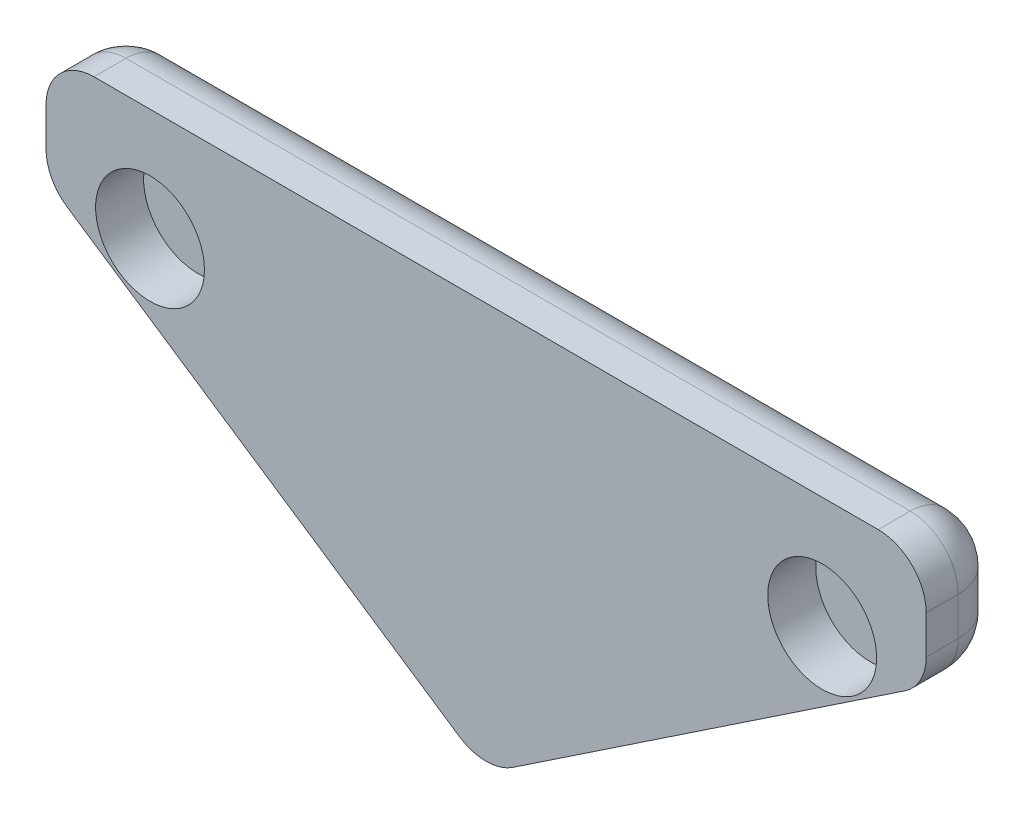
ISO-10303-21;
HEADER;
FILE_DESCRIPTION(('STEP AP214'),'2;1');
FILE_NAME('part.step','',(''),(''),'','','');
FILE_SCHEMA(('AUTOMOTIVE_DESIGN { 1 0 10303 214 1 1 1 1 }'));
ENDSEC;
DATA;
#1=APPLICATION_CONTEXT('core data for automotive mechanical design processes');
#2=APPLICATION_PROTOCOL_DEFINITION('international standard','automotive_design',2000,#1);
#3=PRODUCT_CONTEXT('',#1,'mechanical');
#4=PRODUCT('Part','Part','',(#3));
#5=PRODUCT_RELATED_PRODUCT_CATEGORY('part','',(#4));
#6=PRODUCT_DEFINITION_FORMATION('','',#4);
#7=PRODUCT_DEFINITION_CONTEXT('part definition',#1,'design');
#8=PRODUCT_DEFINITION('design','',#6,#7);
#9=PRODUCT_DEFINITION_SHAPE('','',#8);
#10=(LENGTH_UNIT() NAMED_UNIT(*) SI_UNIT(.MILLI.,.METRE.));
#11=(NAMED_UNIT(*) PLANE_ANGLE_UNIT() SI_UNIT($,.RADIAN.));
#12=(NAMED_UNIT(*) SI_UNIT($,.STERADIAN.) SOLID_ANGLE_UNIT());
#13=UNCERTAINTY_MEASURE_WITH_UNIT(LENGTH_MEASURE(1.E-05),#10,'distance_accuracy_value','');
#14=(GEOMETRIC_REPRESENTATION_CONTEXT(3) GLOBAL_UNCERTAINTY_ASSIGNED_CONTEXT((#13)) GLOBAL_UNIT_ASSIGNED_CONTEXT((#10,
#11,#12)) REPRESENTATION_CONTEXT('',''));
#15=CARTESIAN_POINT('',(0.,0.,0.));
#16=DIRECTION('',(0.,0.,1.));
#17=DIRECTION('',(1.,0.,0.));
#18=AXIS2_PLACEMENT_3D('',#15,#16,#17);
#19=CARTESIAN_POINT('',(6.18580381973495,12.7,2.5));
#20=DIRECTION('',(0.,-1.,0.));
#21=DIRECTION('',(1.,0.,0.));
#22=AXIS2_PLACEMENT_3D('',#19,#20,#21);
#23=PLANE('',#22);
#24=DIRECTION('',(-1.,0.,0.));
#25=VECTOR('',#24,1.);
#26=CARTESIAN_POINT('',(6.18580381973495,12.7,2.5));
#27=LINE('',#26,#25);
#28=CARTESIAN_POINT('',(18.4358038197349,12.7,2.5));
#29=VERTEX_POINT('',#28);
#30=CARTESIAN_POINT('',(-6.06419618026506,12.7,2.5));
#31=VERTEX_POINT('',#30);
#32=EDGE_CURVE('E307',#29,#31,#27,.T.);
#33=ORIENTED_EDGE('',*,*,#32,.F.);
#34=DIRECTION('',(0.,0.,-1.));
#35=VECTOR('',#34,1.);
#36=CARTESIAN_POINT('',(18.4358038197349,12.7,2.5));
#37=LINE('',#36,#35);
#38=CARTESIAN_POINT('',(18.4358038197349,12.7,1.5));
#39=VERTEX_POINT('',#38);
#40=EDGE_CURVE('E197',#29,#39,#37,.T.);
#41=ORIENTED_EDGE('',*,*,#40,.T.);
#42=DIRECTION('',(-1.,0.,0.));
#43=VECTOR('',#42,1.);
#44=CARTESIAN_POINT('',(6.18580381973495,12.7,1.5));
#45=LINE('',#44,#43);
#46=CARTESIAN_POINT('',(-6.06419618026506,12.7,1.5));
#47=VERTEX_POINT('',#46);
#48=EDGE_CURVE('E150',#39,#47,#45,.T.);
#49=ORIENTED_EDGE('',*,*,#48,.T.);
#50=DIRECTION('',(0.,0.,-1.));
#51=VECTOR('',#50,1.);
#52=CARTESIAN_POINT('',(-6.06419618026506,12.7,2.5));
#53=LINE('',#52,#51);
#54=EDGE_CURVE('E194',#47,#31,#53,.F.);
#55=ORIENTED_EDGE('',*,*,#54,.T.);
#56=EDGE_LOOP('',(#33,#41,#49,#55));
#57=FACE_BOUND('',#56,.T.);
#58=ADVANCED_FACE('F45',(#57),#23,.F.);
#59=CARTESIAN_POINT('',(-7.56419618026505,12.7,2.5));
#60=DIRECTION('',(1.,0.,0.));
#61=DIRECTION('',(0.,1.,0.));
#62=AXIS2_PLACEMENT_3D('',#59,#60,#61);
#63=PLANE('',#62);
#64=DIRECTION('',(0.,-1.,0.));
#65=VECTOR('',#64,1.);
#66=CARTESIAN_POINT('',(-7.56419618026505,12.7,1.5));
#67=LINE('',#66,#65);
#68=CARTESIAN_POINT('',(-7.56419618026506,11.2,1.5));
#69=VERTEX_POINT('',#68);
#70=CARTESIAN_POINT('',(-7.56419618026506,10.0011589018753,1.5));
#71=VERTEX_POINT('',#70);
#72=EDGE_CURVE('E167',#69,#71,#67,.T.);
#73=ORIENTED_EDGE('',*,*,#72,.T.);
#74=DIRECTION('',(0.,0.,-1.));
#75=VECTOR('',#74,1.);
#76=CARTESIAN_POINT('',(-7.56419618026506,10.0011589018753,2.5));
#77=LINE('',#76,#75);
#78=CARTESIAN_POINT('',(-7.56419618026506,10.0011589018753,2.5));
#79=VERTEX_POINT('',#78);
#80=EDGE_CURVE('E178',#71,#79,#77,.F.);
#81=ORIENTED_EDGE('',*,*,#80,.T.);
#82=DIRECTION('',(0.,-1.,0.));
#83=VECTOR('',#82,1.);
#84=CARTESIAN_POINT('',(-7.56419618026505,12.7,2.5));
#85=LINE('',#84,#83);
#86=CARTESIAN_POINT('',(-7.56419618026506,11.2,2.5));
#87=VERTEX_POINT('',#86);
#88=EDGE_CURVE('E145',#87,#79,#85,.T.);
#89=ORIENTED_EDGE('',*,*,#88,.F.);
#90=DIRECTION('',(0.,0.,-1.));
#91=VECTOR('',#90,1.);
#92=CARTESIAN_POINT('',(-7.56419618026506,11.2,2.5));
#93=LINE('',#92,#91);
#94=EDGE_CURVE('E171',#87,#69,#93,.T.);
#95=ORIENTED_EDGE('',*,*,#94,.T.);
#96=EDGE_LOOP('',(#73,#81,#89,#95));
#97=FACE_BOUND('',#96,.T.);
#98=ADVANCED_FACE('F380',(#97),#63,.F.);
#99=CARTESIAN_POINT('',(-7.56419618026506,9.19999999999999,2.5));
#100=DIRECTION('',(0.556094302115672,0.831119201531576,0.));
#101=DIRECTION('',(-0.831119201531576,0.556094302115672,0.));
#102=AXIS2_PLACEMENT_3D('',#99,#100,#101);
#103=PLANE('',#102);
#104=DIRECTION('',(0.831119201531576,-0.556094302115672,0.));
#105=VECTOR('',#104,1.);
#106=CARTESIAN_POINT('',(-7.56419618026506,9.19999999999999,2.5));
#107=LINE('',#106,#105);
#108=CARTESIAN_POINT('',(-6.89833763343856,8.7544800995779,2.5));
#109=VERTEX_POINT('',#108);
#110=CARTESIAN_POINT('',(5.35166236656144,0.558116463214275,2.5));
#111=VERTEX_POINT('',#110);
#112=EDGE_CURVE('E142',#109,#111,#107,.T.);
#113=ORIENTED_EDGE('',*,*,#112,.F.);
#114=DIRECTION('',(0.,0.,-1.));
#115=VECTOR('',#114,1.);
#116=CARTESIAN_POINT('',(-6.89833763343856,8.7544800995779,2.5));
#117=LINE('',#116,#115);
#118=CARTESIAN_POINT('',(-6.89833763343856,8.7544800995779,1.5));
#119=VERTEX_POINT('',#118);
#120=EDGE_CURVE('E156',#109,#119,#117,.T.);
#121=ORIENTED_EDGE('',*,*,#120,.T.);
#122=DIRECTION('',(0.831119201531576,-0.556094302115672,0.));
#123=VECTOR('',#122,1.);
#124=CARTESIAN_POINT('',(-7.56419618026506,9.19999999999999,1.5));
#125=LINE('',#124,#123);
#126=CARTESIAN_POINT('',(5.35166236656144,0.558116463214273,1.5));
#127=VERTEX_POINT('',#126);
#128=EDGE_CURVE('E160',#119,#127,#125,.T.);
#129=ORIENTED_EDGE('',*,*,#128,.T.);
#130=DIRECTION('',(0.,0.,-1.));
#131=VECTOR('',#130,1.);
#132=CARTESIAN_POINT('',(5.35166236656144,0.558116463214272,2.5));
#133=LINE('',#132,#131);
#134=EDGE_CURVE('E158',#127,#111,#133,.F.);
#135=ORIENTED_EDGE('',*,*,#134,.T.);
#136=EDGE_LOOP('',(#113,#121,#129,#135));
#137=FACE_BOUND('',#136,.T.);
#138=ADVANCED_FACE('F155',(#137),#103,.F.);
#139=CARTESIAN_POINT('',(0.,0.,2.5));
#140=DIRECTION('',(0.,0.,1.));
#141=DIRECTION('',(1.,0.,0.));
#142=AXIS2_PLACEMENT_3D('',#139,#140,#141);
#143=PLANE('',#142);
#144=CARTESIAN_POINT('',(-4.31419618026505,9.2,2.5));
#145=DIRECTION('',(0.,0.,1.));
#146=DIRECTION('',(1.,0.,0.));
#147=AXIS2_PLACEMENT_3D('',#144,#145,#146);
#148=CIRCLE('',#147,1.7);
#149=CARTESIAN_POINT('',(-2.61419618026505,9.2,2.5));
#150=VERTEX_POINT('',#149);
#151=EDGE_CURVE('E302',#150,#150,#148,.T.);
#152=ORIENTED_EDGE('',*,*,#151,.F.);
#153=EDGE_LOOP('',(#152));
#154=FACE_BOUND('',#153,.T.);
#155=ORIENTED_EDGE('',*,*,#88,.T.);
#156=CARTESIAN_POINT('',(-6.06419618026506,10.0011589018753,2.5));
#157=DIRECTION('',(0.,0.,1.));
#158=DIRECTION('',(1.,0.,0.));
#159=AXIS2_PLACEMENT_3D('',#156,#157,#158);
#160=CIRCLE('',#159,1.5);
#161=EDGE_CURVE('E138',#79,#109,#160,.T.);
#162=ORIENTED_EDGE('',*,*,#161,.T.);
#163=ORIENTED_EDGE('',*,*,#112,.T.);
#164=CARTESIAN_POINT('',(6.18580381973495,1.80479526551163,2.5));
#165=DIRECTION('',(0.,0.,1.));
#166=DIRECTION('',(1.,0.,0.));
#167=AXIS2_PLACEMENT_3D('',#164,#165,#166);
#168=CIRCLE('',#167,1.5);
#169=CARTESIAN_POINT('',(7.01994527290846,0.558116463214273,2.5));
#170=VERTEX_POINT('',#169);
#171=EDGE_CURVE('E184',#111,#170,#168,.T.);
#172=ORIENTED_EDGE('',*,*,#171,.T.);
#173=DIRECTION('',(-0.831119201531576,-0.556094302115672,0.));
#174=VECTOR('',#173,1.);
#175=CARTESIAN_POINT('',(19.935803819735,9.19999999999999,2.5));
#176=LINE('',#175,#174);
#177=CARTESIAN_POINT('',(19.2699452729085,8.7544800995779,2.5));
#178=VERTEX_POINT('',#177);
#179=EDGE_CURVE('E298',#178,#170,#176,.T.);
#180=ORIENTED_EDGE('',*,*,#179,.F.);
#181=CARTESIAN_POINT('',(18.435803819735,10.0011589018753,2.5));
#182=DIRECTION('',(0.,0.,1.));
#183=DIRECTION('',(1.,0.,0.));
#184=AXIS2_PLACEMENT_3D('',#181,#182,#183);
#185=CIRCLE('',#184,1.5);
#186=CARTESIAN_POINT('',(19.935803819735,10.0011589018753,2.5));
#187=VERTEX_POINT('',#186);
#188=EDGE_CURVE('E187',#178,#187,#185,.T.);
#189=ORIENTED_EDGE('',*,*,#188,.T.);
#190=DIRECTION('',(0.,-1.,0.));
#191=VECTOR('',#190,1.);
#192=CARTESIAN_POINT('',(19.935803819735,12.7,2.5));
#193=LINE('',#192,#191);
#194=CARTESIAN_POINT('',(19.935803819735,11.2,2.5));
#195=VERTEX_POINT('',#194);
#196=EDGE_CURVE('E292',#195,#187,#193,.T.);
#197=ORIENTED_EDGE('',*,*,#196,.F.);
#198=CARTESIAN_POINT('',(18.4358038197349,11.2,2.5));
#199=DIRECTION('',(0.,0.,1.));
#200=DIRECTION('',(1.,0.,0.));
#201=AXIS2_PLACEMENT_3D('',#198,#199,#200);
#202=CIRCLE('',#201,1.5);
#203=EDGE_CURVE('E151',#195,#29,#202,.T.);
#204=ORIENTED_EDGE('',*,*,#203,.T.);
#205=ORIENTED_EDGE('',*,*,#32,.T.);
#206=CARTESIAN_POINT('',(-6.06419618026506,11.2,2.5));
#207=DIRECTION('',(0.,0.,1.));
#208=DIRECTION('',(1.,0.,0.));
#209=AXIS2_PLACEMENT_3D('',#206,#207,#208);
#210=CIRCLE('',#209,1.5);
#211=EDGE_CURVE('E181',#31,#87,#210,.T.);
#212=ORIENTED_EDGE('',*,*,#211,.T.);
#213=EDGE_LOOP('',(#155,#162,#163,#172,#180,#189,#197,#204,#205,#212));
#214=FACE_BOUND('',#213,.T.);
#215=CARTESIAN_POINT('',(16.685803819735,9.2,2.5));
#216=DIRECTION('',(0.,0.,-1.));
#217=DIRECTION('',(-1.,0.,0.));
#218=AXIS2_PLACEMENT_3D('',#215,#216,#217);
#219=CIRCLE('',#218,1.7);
#220=CARTESIAN_POINT('',(14.985803819735,9.2,2.5));
#221=VERTEX_POINT('',#220);
#222=EDGE_CURVE('E283',#221,#221,#219,.T.);
#223=ORIENTED_EDGE('',*,*,#222,.T.);
#224=EDGE_LOOP('',(#223));
#225=FACE_BOUND('',#224,.T.);
#226=ADVANCED_FACE('F140',(#154,#214,#225),#143,.T.);
#227=CARTESIAN_POINT('',(0.,0.,0.));
#228=DIRECTION('',(0.,0.,1.));
#229=DIRECTION('',(1.,0.,0.));
#230=AXIS2_PLACEMENT_3D('',#227,#228,#229);
#231=PLANE('',#230);
#232=DIRECTION('',(-1.,0.,0.));
#233=VECTOR('',#232,1.);
#234=CARTESIAN_POINT('',(0.,11.2,0.));
#235=LINE('',#234,#233);
#236=CARTESIAN_POINT('',(-6.06419618026506,11.2,0.));
#237=VERTEX_POINT('',#236);
#238=CARTESIAN_POINT('',(18.4358038197349,11.2,0.));
#239=VERTEX_POINT('',#238);
#240=EDGE_CURVE('E218',#237,#239,#235,.F.);
#241=ORIENTED_EDGE('',*,*,#240,.T.);
#242=DIRECTION('',(0.,-1.,0.));
#243=VECTOR('',#242,1.);
#244=CARTESIAN_POINT('',(18.435803819735,0.,0.));
#245=LINE('',#244,#243);
#246=CARTESIAN_POINT('',(18.435803819735,10.0011589018753,0.));
#247=VERTEX_POINT('',#246);
#248=EDGE_CURVE('E11',#239,#247,#245,.T.);
#249=ORIENTED_EDGE('',*,*,#248,.T.);
#250=DIRECTION('',(-0.831119201531576,-0.556094302115672,0.));
#251=VECTOR('',#250,1.);
#252=CARTESIAN_POINT('',(1.07876191929246,-1.61228004242079,0.));
#253=LINE('',#252,#251);
#254=CARTESIAN_POINT('',(6.18580381973495,1.80479526551164,0.));
#255=VERTEX_POINT('',#254);
#256=EDGE_CURVE('E55',#247,#255,#253,.T.);
#257=ORIENTED_EDGE('',*,*,#256,.T.);
#258=DIRECTION('',(0.831119201531576,-0.556094302115672,0.));
#259=VECTOR('',#258,1.);
#260=CARTESIAN_POINT('',(2.74704482563947,4.10563764701552,0.));
#261=LINE('',#260,#259);
#262=CARTESIAN_POINT('',(-6.06419618026506,10.0011589018753,0.));
#263=VERTEX_POINT('',#262);
#264=EDGE_CURVE('E224',#255,#263,#261,.F.);
#265=ORIENTED_EDGE('',*,*,#264,.T.);
#266=DIRECTION('',(0.,-1.,0.));
#267=VECTOR('',#266,1.);
#268=CARTESIAN_POINT('',(-6.06419618026507,0.,0.));
#269=LINE('',#268,#267);
#270=EDGE_CURVE('E221',#263,#237,#269,.F.);
#271=ORIENTED_EDGE('',*,*,#270,.T.);
#272=EDGE_LOOP('',(#241,#249,#257,#265,#271));
#273=FACE_BOUND('',#272,.T.);
#274=ADVANCED_FACE('F329',(#273),#231,.F.);
#275=CARTESIAN_POINT('',(-4.31419618026505,9.2,1.));
#276=DIRECTION('',(0.,0.,1.));
#277=DIRECTION('',(1.,0.,0.));
#278=AXIS2_PLACEMENT_3D('',#275,#276,#277);
#279=CYLINDRICAL_SURFACE('',#278,1.7);
#280=CARTESIAN_POINT('',(-4.31419618026505,9.2,1.));
#281=DIRECTION('',(0.,0.,1.));
#282=DIRECTION('',(1.,0.,0.));
#283=AXIS2_PLACEMENT_3D('',#280,#281,#282);
#284=CIRCLE('',#283,1.7);
#285=CARTESIAN_POINT('',(-2.61419618026505,9.2,1.));
#286=VERTEX_POINT('',#285);
#287=EDGE_CURVE('E303',#286,#286,#284,.T.);
#288=ORIENTED_EDGE('',*,*,#287,.F.);
#289=EDGE_LOOP('',(#288));
#290=FACE_BOUND('',#289,.T.);
#291=ORIENTED_EDGE('',*,*,#151,.T.);
#292=EDGE_LOOP('',(#291));
#293=FACE_BOUND('',#292,.T.);
#294=ADVANCED_FACE('F579',(#290,#293),#279,.F.);
#295=CARTESIAN_POINT('',(-4.31419618026505,9.2,1.));
#296=DIRECTION('',(0.,0.,1.));
#297=DIRECTION('',(1.,0.,0.));
#298=AXIS2_PLACEMENT_3D('',#295,#296,#297);
#299=PLANE('',#298);
#300=ORIENTED_EDGE('',*,*,#287,.T.);
#301=EDGE_LOOP('',(#300));
#302=FACE_BOUND('',#301,.T.);
#303=ADVANCED_FACE('F567',(#302),#299,.T.);
#304=CARTESIAN_POINT('',(19.935803819735,12.7,2.5));
#305=DIRECTION('',(-1.,0.,0.));
#306=DIRECTION('',(0.,1.,0.));
#307=AXIS2_PLACEMENT_3D('',#304,#305,#306);
#308=PLANE('',#307);
#309=DIRECTION('',(0.,-1.,0.));
#310=VECTOR('',#309,1.);
#311=CARTESIAN_POINT('',(19.935803819735,12.7,1.5));
#312=LINE('',#311,#310);
#313=CARTESIAN_POINT('',(19.935803819735,10.0011589018753,1.5));
#314=VERTEX_POINT('',#313);
#315=CARTESIAN_POINT('',(19.935803819735,11.2,1.5));
#316=VERTEX_POINT('',#315);
#317=EDGE_CURVE('E200',#314,#316,#312,.F.);
#318=ORIENTED_EDGE('',*,*,#317,.T.);
#319=DIRECTION('',(0.,0.,-1.));
#320=VECTOR('',#319,1.);
#321=CARTESIAN_POINT('',(19.935803819735,11.2,2.5));
#322=LINE('',#321,#320);
#323=EDGE_CURVE('E206',#316,#195,#322,.F.);
#324=ORIENTED_EDGE('',*,*,#323,.T.);
#325=ORIENTED_EDGE('',*,*,#196,.T.);
#326=DIRECTION('',(0.,0.,-1.));
#327=VECTOR('',#326,1.);
#328=CARTESIAN_POINT('',(19.935803819735,10.0011589018753,2.5));
#329=LINE('',#328,#327);
#330=EDGE_CURVE('E203',#187,#314,#329,.T.);
#331=ORIENTED_EDGE('',*,*,#330,.T.);
#332=EDGE_LOOP('',(#318,#324,#325,#331));
#333=FACE_BOUND('',#332,.T.);
#334=ADVANCED_FACE('F359',(#333),#308,.F.);
#335=CARTESIAN_POINT('',(19.935803819735,9.19999999999999,2.5));
#336=DIRECTION('',(-0.556094302115672,0.831119201531576,0.));
#337=DIRECTION('',(0.831119201531576,0.556094302115672,0.));
#338=AXIS2_PLACEMENT_3D('',#335,#336,#337);
#339=PLANE('',#338);
#340=DIRECTION('',(-0.831119201531576,-0.556094302115672,0.));
#341=VECTOR('',#340,1.);
#342=CARTESIAN_POINT('',(19.935803819735,9.19999999999999,1.5));
#343=LINE('',#342,#341);
#344=CARTESIAN_POINT('',(7.01994527290846,0.558116463214272,1.5));
#345=VERTEX_POINT('',#344);
#346=CARTESIAN_POINT('',(19.2699452729085,8.7544800995779,1.5));
#347=VERTEX_POINT('',#346);
#348=EDGE_CURVE('E212',#345,#347,#343,.F.);
#349=ORIENTED_EDGE('',*,*,#348,.T.);
#350=DIRECTION('',(0.,0.,-1.));
#351=VECTOR('',#350,1.);
#352=CARTESIAN_POINT('',(19.2699452729085,8.7544800995779,2.5));
#353=LINE('',#352,#351);
#354=EDGE_CURVE('E215',#347,#178,#353,.F.);
#355=ORIENTED_EDGE('',*,*,#354,.T.);
#356=ORIENTED_EDGE('',*,*,#179,.T.);
#357=DIRECTION('',(0.,0.,-1.));
#358=VECTOR('',#357,1.);
#359=CARTESIAN_POINT('',(7.01994527290846,0.558116463214272,2.5));
#360=LINE('',#359,#358);
#361=EDGE_CURVE('E209',#170,#345,#360,.T.);
#362=ORIENTED_EDGE('',*,*,#361,.T.);
#363=EDGE_LOOP('',(#349,#355,#356,#362));
#364=FACE_BOUND('',#363,.T.);
#365=ADVANCED_FACE('F367',(#364),#339,.F.);
#366=CARTESIAN_POINT('',(16.685803819735,9.2,1.));
#367=DIRECTION('',(0.,0.,1.));
#368=DIRECTION('',(-1.,0.,0.));
#369=AXIS2_PLACEMENT_3D('',#366,#367,#368);
#370=CYLINDRICAL_SURFACE('',#369,1.7);
#371=CARTESIAN_POINT('',(16.685803819735,9.2,1.));
#372=DIRECTION('',(0.,0.,-1.));
#373=DIRECTION('',(-1.,0.,0.));
#374=AXIS2_PLACEMENT_3D('',#371,#372,#373);
#375=CIRCLE('',#374,1.7);
#376=CARTESIAN_POINT('',(14.985803819735,9.2,1.));
#377=VERTEX_POINT('',#376);
#378=EDGE_CURVE('E287',#377,#377,#375,.T.);
#379=ORIENTED_EDGE('',*,*,#378,.T.);
#380=EDGE_LOOP('',(#379));
#381=FACE_BOUND('',#380,.T.);
#382=ORIENTED_EDGE('',*,*,#222,.F.);
#383=EDGE_LOOP('',(#382));
#384=FACE_BOUND('',#383,.T.);
#385=ADVANCED_FACE('F554',(#381,#384),#370,.F.);
#386=CARTESIAN_POINT('',(16.685803819735,9.2,1.));
#387=DIRECTION('',(0.,0.,1.));
#388=DIRECTION('',(-1.,0.,0.));
#389=AXIS2_PLACEMENT_3D('',#386,#387,#388);
#390=PLANE('',#389);
#391=ORIENTED_EDGE('',*,*,#378,.F.);
#392=EDGE_LOOP('',(#391));
#393=FACE_BOUND('',#392,.T.);
#394=ADVANCED_FACE('F542',(#393),#390,.T.);
#395=CARTESIAN_POINT('',(18.435803819735,10.0011589018753,2.5));
#396=DIRECTION('',(0.,0.,-1.));
#397=DIRECTION('',(-1.,0.,0.));
#398=AXIS2_PLACEMENT_3D('',#395,#396,#397);
#399=CYLINDRICAL_SURFACE('',#398,1.5);
#400=ORIENTED_EDGE('',*,*,#188,.F.);
#401=ORIENTED_EDGE('',*,*,#354,.F.);
#402=CARTESIAN_POINT('',(18.435803819735,10.0011589018753,1.5));
#403=DIRECTION('',(0.,0.,-1.));
#404=DIRECTION('',(-1.,0.,0.));
#405=AXIS2_PLACEMENT_3D('',#402,#403,#404);
#406=CIRCLE('',#405,1.5);
#407=EDGE_CURVE('E49',#314,#347,#406,.T.);
#408=ORIENTED_EDGE('',*,*,#407,.F.);
#409=ORIENTED_EDGE('',*,*,#330,.F.);
#410=EDGE_LOOP('',(#400,#401,#408,#409));
#411=FACE_BOUND('',#410,.T.);
#412=ADVANCED_FACE('F47',(#411),#399,.T.);
#413=CARTESIAN_POINT('',(18.435803819735,0.,1.5));
#414=DIRECTION('',(0.,-1.,0.));
#415=DIRECTION('',(1.,0.,0.));
#416=AXIS2_PLACEMENT_3D('',#413,#414,#415);
#417=CYLINDRICAL_SURFACE('',#416,1.5);
#418=CARTESIAN_POINT('',(18.4358038197349,11.2,1.5));
#419=DIRECTION('',(0.,1.,0.));
#420=DIRECTION('',(-1.,0.,0.));
#421=AXIS2_PLACEMENT_3D('',#418,#419,#420);
#422=CIRCLE('',#421,1.5);
#423=EDGE_CURVE('E273',#316,#239,#422,.T.);
#424=ORIENTED_EDGE('',*,*,#423,.F.);
#425=ORIENTED_EDGE('',*,*,#317,.F.);
#426=CARTESIAN_POINT('',(18.435803819735,10.0011589018753,1.5));
#427=DIRECTION('',(0.,-1.,0.));
#428=DIRECTION('',(1.,0.,0.));
#429=AXIS2_PLACEMENT_3D('',#426,#427,#428);
#430=CIRCLE('',#429,1.5);
#431=EDGE_CURVE('E276',#247,#314,#430,.T.);
#432=ORIENTED_EDGE('',*,*,#431,.F.);
#433=ORIENTED_EDGE('',*,*,#248,.F.);
#434=EDGE_LOOP('',(#424,#425,#432,#433));
#435=FACE_BOUND('',#434,.T.);
#436=ADVANCED_FACE('F347',(#435),#417,.T.);
#437=CARTESIAN_POINT('',(18.4358038197349,11.2,2.5));
#438=DIRECTION('',(0.,0.,-1.));
#439=DIRECTION('',(-1.,0.,0.));
#440=AXIS2_PLACEMENT_3D('',#437,#438,#439);
#441=CYLINDRICAL_SURFACE('',#440,1.5);
#442=ORIENTED_EDGE('',*,*,#203,.F.);
#443=ORIENTED_EDGE('',*,*,#323,.F.);
#444=CARTESIAN_POINT('',(18.4358038197349,11.2,1.5));
#445=DIRECTION('',(0.,0.,-1.));
#446=DIRECTION('',(-1.,0.,0.));
#447=AXIS2_PLACEMENT_3D('',#444,#445,#446);
#448=CIRCLE('',#447,1.5);
#449=EDGE_CURVE('E269',#39,#316,#448,.T.);
#450=ORIENTED_EDGE('',*,*,#449,.F.);
#451=ORIENTED_EDGE('',*,*,#40,.F.);
#452=EDGE_LOOP('',(#442,#443,#450,#451));
#453=FACE_BOUND('',#452,.T.);
#454=ADVANCED_FACE('F356',(#453),#441,.T.);
#455=CARTESIAN_POINT('',(18.435803819735,10.0011589018753,1.5));
#456=DIRECTION('',(0.,0.,-1.));
#457=DIRECTION('',(-1.,0.,0.));
#458=AXIS2_PLACEMENT_3D('',#455,#456,#457);
#459=SPHERICAL_SURFACE('',#458,1.5);
#460=ORIENTED_EDGE('',*,*,#431,.T.);
#461=ORIENTED_EDGE('',*,*,#407,.T.);
#462=CARTESIAN_POINT('',(18.435803819735,10.0011589018753,1.5));
#463=DIRECTION('',(0.831119201531575,0.556094302115673,0.));
#464=DIRECTION('',(-0.556094302115673,0.831119201531575,0.));
#465=AXIS2_PLACEMENT_3D('',#462,#463,#464);
#466=CIRCLE('',#465,1.5);
#467=EDGE_CURVE('E266',#247,#347,#466,.F.);
#468=ORIENTED_EDGE('',*,*,#467,.F.);
#469=EDGE_LOOP('',(#460,#461,#468));
#470=FACE_BOUND('',#469,.T.);
#471=ADVANCED_FACE('F370',(#470),#459,.T.);
#472=CARTESIAN_POINT('',(18.4358038197349,11.2,1.5));
#473=DIRECTION('',(1.,0.,0.));
#474=DIRECTION('',(0.,1.,0.));
#475=AXIS2_PLACEMENT_3D('',#472,#473,#474);
#476=SPHERICAL_SURFACE('',#475,1.5);
#477=ORIENTED_EDGE('',*,*,#449,.T.);
#478=ORIENTED_EDGE('',*,*,#423,.T.);
#479=CARTESIAN_POINT('',(18.4358038197349,11.2,1.5));
#480=DIRECTION('',(1.,0.,0.));
#481=DIRECTION('',(0.,0.,-1.));
#482=AXIS2_PLACEMENT_3D('',#479,#480,#481);
#483=CIRCLE('',#482,1.5);
#484=EDGE_CURVE('E262',#39,#239,#483,.F.);
#485=ORIENTED_EDGE('',*,*,#484,.F.);
#486=EDGE_LOOP('',(#477,#478,#485));
#487=FACE_BOUND('',#486,.T.);
#488=ADVANCED_FACE('F350',(#487),#476,.T.);
#489=CARTESIAN_POINT('',(6.18580381973495,1.80479526551163,2.5));
#490=DIRECTION('',(0.,0.,-1.));
#491=DIRECTION('',(-1.,0.,0.));
#492=AXIS2_PLACEMENT_3D('',#489,#490,#491);
#493=CYLINDRICAL_SURFACE('',#492,1.5);
#494=ORIENTED_EDGE('',*,*,#171,.F.);
#495=ORIENTED_EDGE('',*,*,#134,.F.);
#496=CARTESIAN_POINT('',(6.18580381973495,1.80479526551164,1.5));
#497=DIRECTION('',(0.,0.,-1.));
#498=DIRECTION('',(-1.,0.,0.));
#499=AXIS2_PLACEMENT_3D('',#496,#497,#498);
#500=CIRCLE('',#499,1.5);
#501=EDGE_CURVE('E258',#345,#127,#500,.T.);
#502=ORIENTED_EDGE('',*,*,#501,.F.);
#503=ORIENTED_EDGE('',*,*,#361,.F.);
#504=EDGE_LOOP('',(#494,#495,#502,#503));
#505=FACE_BOUND('',#504,.T.);
#506=ADVANCED_FACE('F321',(#505),#493,.T.);
#507=CARTESIAN_POINT('',(1.07876191929246,-1.61228004242079,1.5));
#508=DIRECTION('',(-0.831119201531576,-0.556094302115672,0.));
#509=DIRECTION('',(0.556094302115672,-0.831119201531576,0.));
#510=AXIS2_PLACEMENT_3D('',#507,#508,#509);
#511=CYLINDRICAL_SURFACE('',#510,1.5);
#512=ORIENTED_EDGE('',*,*,#467,.T.);
#513=ORIENTED_EDGE('',*,*,#348,.F.);
#514=CARTESIAN_POINT('',(6.18580381973495,1.80479526551164,1.5));
#515=DIRECTION('',(-0.831119201531576,-0.556094302115671,0.));
#516=DIRECTION('',(0.556094302115671,-0.831119201531576,0.));
#517=AXIS2_PLACEMENT_3D('',#514,#515,#516);
#518=CIRCLE('',#517,1.5);
#519=EDGE_CURVE('E254',#255,#345,#518,.T.);
#520=ORIENTED_EDGE('',*,*,#519,.F.);
#521=ORIENTED_EDGE('',*,*,#256,.F.);
#522=EDGE_LOOP('',(#512,#513,#520,#521));
#523=FACE_BOUND('',#522,.T.);
#524=ADVANCED_FACE('F369',(#523),#511,.T.);
#525=CARTESIAN_POINT('',(6.18580381973495,11.2,1.5));
#526=DIRECTION('',(-1.,0.,0.));
#527=DIRECTION('',(0.,-1.,0.));
#528=AXIS2_PLACEMENT_3D('',#525,#526,#527);
#529=CYLINDRICAL_SURFACE('',#528,1.5);
#530=ORIENTED_EDGE('',*,*,#484,.T.);
#531=ORIENTED_EDGE('',*,*,#240,.F.);
#532=CARTESIAN_POINT('',(-6.06419618026506,11.2,1.5));
#533=DIRECTION('',(-1.,0.,0.));
#534=DIRECTION('',(0.,0.,1.));
#535=AXIS2_PLACEMENT_3D('',#532,#533,#534);
#536=CIRCLE('',#535,1.5);
#537=EDGE_CURVE('E250',#47,#237,#536,.T.);
#538=ORIENTED_EDGE('',*,*,#537,.F.);
#539=ORIENTED_EDGE('',*,*,#48,.F.);
#540=EDGE_LOOP('',(#530,#531,#538,#539));
#541=FACE_BOUND('',#540,.T.);
#542=ADVANCED_FACE('F342',(#541),#529,.T.);
#543=CARTESIAN_POINT('',(-6.06419618026506,11.2,2.5));
#544=DIRECTION('',(0.,0.,-1.));
#545=DIRECTION('',(-1.,0.,0.));
#546=AXIS2_PLACEMENT_3D('',#543,#544,#545);
#547=CYLINDRICAL_SURFACE('',#546,1.5);
#548=ORIENTED_EDGE('',*,*,#211,.F.);
#549=ORIENTED_EDGE('',*,*,#54,.F.);
#550=CARTESIAN_POINT('',(-6.06419618026506,11.2,1.5));
#551=DIRECTION('',(0.,0.,-1.));
#552=DIRECTION('',(-1.,0.,0.));
#553=AXIS2_PLACEMENT_3D('',#550,#551,#552);
#554=CIRCLE('',#553,1.5);
#555=EDGE_CURVE('E246',#69,#47,#554,.T.);
#556=ORIENTED_EDGE('',*,*,#555,.F.);
#557=ORIENTED_EDGE('',*,*,#94,.F.);
#558=EDGE_LOOP('',(#548,#549,#556,#557));
#559=FACE_BOUND('',#558,.T.);
#560=ADVANCED_FACE('F404',(#559),#547,.T.);
#561=CARTESIAN_POINT('',(6.18580381973495,1.80479526551164,1.5));
#562=DIRECTION('',(0.,0.,-1.));
#563=DIRECTION('',(-1.,0.,0.));
#564=AXIS2_PLACEMENT_3D('',#561,#562,#563);
#565=SPHERICAL_SURFACE('',#564,1.5);
#566=ORIENTED_EDGE('',*,*,#519,.T.);
#567=ORIENTED_EDGE('',*,*,#501,.T.);
#568=CARTESIAN_POINT('',(6.18580381973495,1.80479526551164,1.5));
#569=DIRECTION('',(0.831119201531576,-0.556094302115672,0.));
#570=DIRECTION('',(0.556094302115672,0.831119201531576,0.));
#571=AXIS2_PLACEMENT_3D('',#568,#569,#570);
#572=CIRCLE('',#571,1.5);
#573=EDGE_CURVE('E242',#255,#127,#572,.F.);
#574=ORIENTED_EDGE('',*,*,#573,.F.);
#575=EDGE_LOOP('',(#566,#567,#574));
#576=FACE_BOUND('',#575,.T.);
#577=ADVANCED_FACE('F325',(#576),#565,.T.);
#578=CARTESIAN_POINT('',(-6.06419618026506,11.2,1.5));
#579=DIRECTION('',(0.,1.,0.));
#580=DIRECTION('',(0.,0.,1.));
#581=AXIS2_PLACEMENT_3D('',#578,#579,#580);
#582=SPHERICAL_SURFACE('',#581,1.5);
#583=ORIENTED_EDGE('',*,*,#555,.T.);
#584=ORIENTED_EDGE('',*,*,#537,.T.);
#585=CARTESIAN_POINT('',(-6.06419618026506,11.2,1.5));
#586=DIRECTION('',(0.,1.,0.));
#587=DIRECTION('',(-1.,0.,0.));
#588=AXIS2_PLACEMENT_3D('',#585,#586,#587);
#589=CIRCLE('',#588,1.5);
#590=EDGE_CURVE('E238',#69,#237,#589,.F.);
#591=ORIENTED_EDGE('',*,*,#590,.F.);
#592=EDGE_LOOP('',(#583,#584,#591));
#593=FACE_BOUND('',#592,.T.);
#594=ADVANCED_FACE('F337',(#593),#582,.T.);
#595=CARTESIAN_POINT('',(-6.73005472709155,10.4466788022974,1.5));
#596=DIRECTION('',(0.831119201531576,-0.556094302115672,0.));
#597=DIRECTION('',(0.556094302115672,0.831119201531576,0.));
#598=AXIS2_PLACEMENT_3D('',#595,#596,#597);
#599=CYLINDRICAL_SURFACE('',#598,1.5);
#600=ORIENTED_EDGE('',*,*,#573,.T.);
#601=ORIENTED_EDGE('',*,*,#128,.F.);
#602=CARTESIAN_POINT('',(-6.06419618026506,10.0011589018753,1.5));
#603=DIRECTION('',(-0.831119201531576,0.556094302115672,0.));
#604=DIRECTION('',(-0.556094302115672,-0.831119201531576,0.));
#605=AXIS2_PLACEMENT_3D('',#602,#603,#604);
#606=CIRCLE('',#605,1.5);
#607=EDGE_CURVE('E235',#263,#119,#606,.T.);
#608=ORIENTED_EDGE('',*,*,#607,.F.);
#609=ORIENTED_EDGE('',*,*,#264,.F.);
#610=EDGE_LOOP('',(#600,#601,#608,#609));
#611=FACE_BOUND('',#610,.T.);
#612=ADVANCED_FACE('F327',(#611),#599,.T.);
#613=CARTESIAN_POINT('',(-6.06419618026505,12.7,1.5));
#614=DIRECTION('',(0.,-1.,0.));
#615=DIRECTION('',(1.,0.,0.));
#616=AXIS2_PLACEMENT_3D('',#613,#614,#615);
#617=CYLINDRICAL_SURFACE('',#616,1.5);
#618=ORIENTED_EDGE('',*,*,#590,.T.);
#619=ORIENTED_EDGE('',*,*,#270,.F.);
#620=CARTESIAN_POINT('',(-6.06419618026506,10.0011589018753,1.5));
#621=DIRECTION('',(0.,-1.,0.));
#622=DIRECTION('',(1.,0.,0.));
#623=AXIS2_PLACEMENT_3D('',#620,#621,#622);
#624=CIRCLE('',#623,1.5);
#625=EDGE_CURVE('E231',#71,#263,#624,.T.);
#626=ORIENTED_EDGE('',*,*,#625,.F.);
#627=ORIENTED_EDGE('',*,*,#72,.F.);
#628=EDGE_LOOP('',(#618,#619,#626,#627));
#629=FACE_BOUND('',#628,.T.);
#630=ADVANCED_FACE('F333',(#629),#617,.T.);
#631=CARTESIAN_POINT('',(-6.06419618026506,10.0011589018753,1.5));
#632=DIRECTION('',(0.,0.,-1.));
#633=DIRECTION('',(-1.,0.,0.));
#634=AXIS2_PLACEMENT_3D('',#631,#632,#633);
#635=SPHERICAL_SURFACE('',#634,1.5);
#636=ORIENTED_EDGE('',*,*,#625,.T.);
#637=ORIENTED_EDGE('',*,*,#607,.T.);
#638=CARTESIAN_POINT('',(-6.06419618026506,10.0011589018753,1.5));
#639=DIRECTION('',(0.,0.,-1.));
#640=DIRECTION('',(-1.,0.,0.));
#641=AXIS2_PLACEMENT_3D('',#638,#639,#640);
#642=CIRCLE('',#641,1.5);
#643=EDGE_CURVE('E164',#71,#119,#642,.F.);
#644=ORIENTED_EDGE('',*,*,#643,.F.);
#645=EDGE_LOOP('',(#636,#637,#644));
#646=FACE_BOUND('',#645,.T.);
#647=ADVANCED_FACE('F392',(#646),#635,.T.);
#648=CARTESIAN_POINT('',(-6.06419618026506,10.0011589018753,2.5));
#649=DIRECTION('',(0.,0.,-1.));
#650=DIRECTION('',(-1.,0.,0.));
#651=AXIS2_PLACEMENT_3D('',#648,#649,#650);
#652=CYLINDRICAL_SURFACE('',#651,1.5);
#653=ORIENTED_EDGE('',*,*,#161,.F.);
#654=ORIENTED_EDGE('',*,*,#80,.F.);
#655=ORIENTED_EDGE('',*,*,#643,.T.);
#656=ORIENTED_EDGE('',*,*,#120,.F.);
#657=EDGE_LOOP('',(#653,#654,#655,#656));
#658=FACE_BOUND('',#657,.T.);
#659=ADVANCED_FACE('F162',(#658),#652,.T.);
#660=CLOSED_SHELL('',(#58,#98,#138,#226,#274,#294,#303,#334,#365,#385,#394,#412,#436,#454,#471,
#488,#506,#524,#542,#560,#577,#594,#612,#630,#647,#659));
#661=MANIFOLD_SOLID_BREP('B2',#660);
#662=ADVANCED_BREP_SHAPE_REPRESENTATION('',(#18,#661),#14);
#663=SHAPE_DEFINITION_REPRESENTATION(#9,#662);
ENDSEC;
END-ISO-10303-21;
